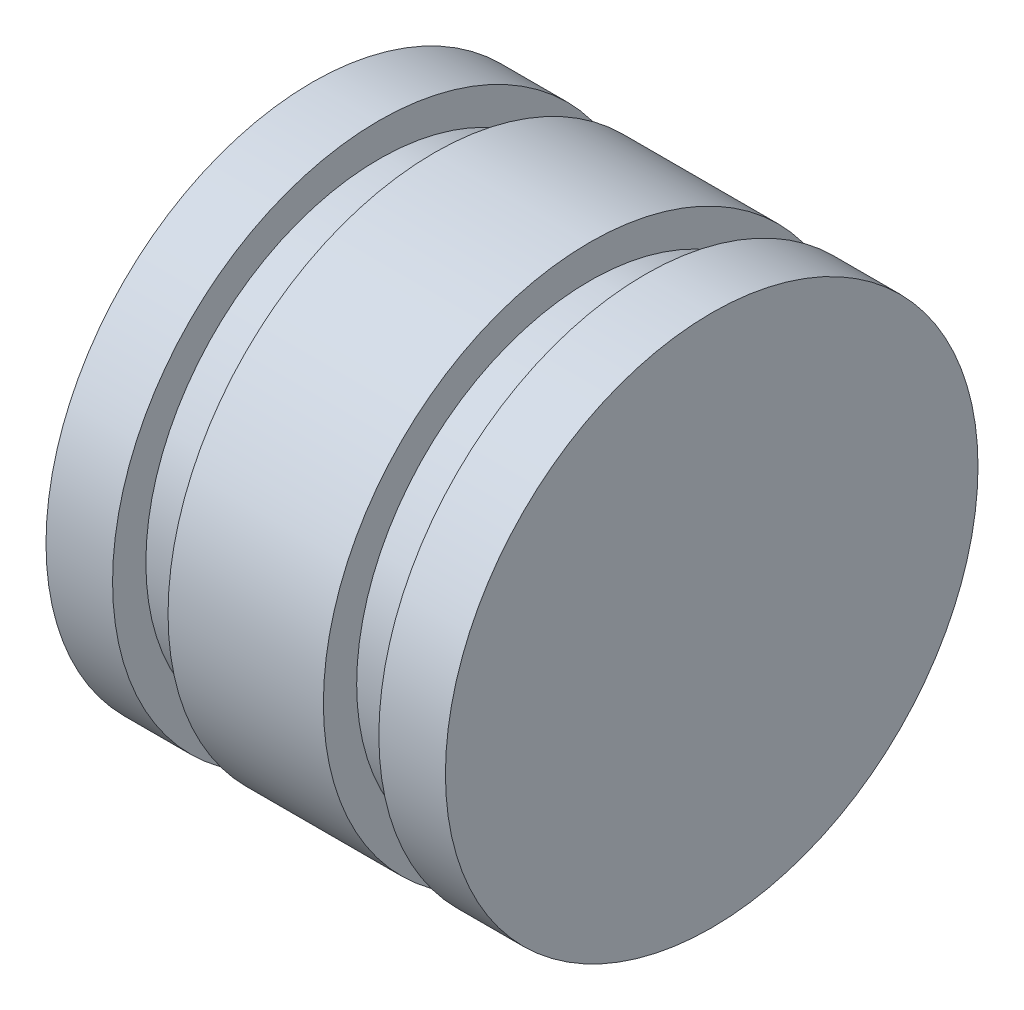
ISO-10303-21;
HEADER;
FILE_DESCRIPTION(('STEP AP214'),'2;1');
FILE_NAME('part.step','',(''),(''),'','','');
FILE_SCHEMA(('AUTOMOTIVE_DESIGN { 1 0 10303 214 1 1 1 1 }'));
ENDSEC;
DATA;
#1=APPLICATION_CONTEXT('core data for automotive mechanical design processes');
#2=APPLICATION_PROTOCOL_DEFINITION('international standard','automotive_design',2000,#1);
#3=PRODUCT_CONTEXT('',#1,'mechanical');
#4=PRODUCT('Part','Part','',(#3));
#5=PRODUCT_RELATED_PRODUCT_CATEGORY('part','',(#4));
#6=PRODUCT_DEFINITION_FORMATION('','',#4);
#7=PRODUCT_DEFINITION_CONTEXT('part definition',#1,'design');
#8=PRODUCT_DEFINITION('design','',#6,#7);
#9=PRODUCT_DEFINITION_SHAPE('','',#8);
#10=(LENGTH_UNIT() NAMED_UNIT(*) SI_UNIT(.MILLI.,.METRE.));
#11=(NAMED_UNIT(*) PLANE_ANGLE_UNIT() SI_UNIT($,.RADIAN.));
#12=(NAMED_UNIT(*) SI_UNIT($,.STERADIAN.) SOLID_ANGLE_UNIT());
#13=UNCERTAINTY_MEASURE_WITH_UNIT(LENGTH_MEASURE(1.E-05),#10,'distance_accuracy_value','');
#14=(GEOMETRIC_REPRESENTATION_CONTEXT(3) GLOBAL_UNCERTAINTY_ASSIGNED_CONTEXT((#13)) GLOBAL_UNIT_ASSIGNED_CONTEXT((#10,
#11,#12)) REPRESENTATION_CONTEXT('',''));
#15=CARTESIAN_POINT('',(0.,0.,0.));
#16=DIRECTION('',(0.,0.,1.));
#17=DIRECTION('',(1.,0.,0.));
#18=AXIS2_PLACEMENT_3D('',#15,#16,#17);
#19=CARTESIAN_POINT('',(-21.3192957770043,0.,-6.3939393939394));
#20=DIRECTION('',(-1.,0.,0.));
#21=DIRECTION('',(0.,0.,1.));
#22=AXIS2_PLACEMENT_3D('',#19,#20,#21);
#23=CYLINDRICAL_SURFACE('',#22,12.);
#24=CARTESIAN_POINT('',(-3.31929577700428,0.,-6.3939393939394));
#25=DIRECTION('',(-1.,0.,0.));
#26=DIRECTION('',(0.,0.,1.));
#27=AXIS2_PLACEMENT_3D('',#24,#25,#26);
#28=CIRCLE('',#27,12.);
#29=CARTESIAN_POINT('',(-3.31929577700428,0.,5.6060606060606));
#30=VERTEX_POINT('',#29);
#31=EDGE_CURVE('E67',#30,#30,#28,.T.);
#32=ORIENTED_EDGE('',*,*,#31,.T.);
#33=EDGE_LOOP('',(#32));
#34=FACE_BOUND('',#33,.T.);
#35=CARTESIAN_POINT('',(-6.31929577700428,0.,-6.3939393939394));
#36=DIRECTION('',(-1.,0.,0.));
#37=DIRECTION('',(0.,0.,1.));
#38=AXIS2_PLACEMENT_3D('',#35,#36,#37);
#39=CIRCLE('',#38,12.);
#40=CARTESIAN_POINT('',(-6.31929577700428,0.,5.6060606060606));
#41=VERTEX_POINT('',#40);
#42=EDGE_CURVE('E10',#41,#41,#39,.T.);
#43=ORIENTED_EDGE('',*,*,#42,.F.);
#44=EDGE_LOOP('',(#43));
#45=FACE_BOUND('',#44,.T.);
#46=ADVANCED_FACE('F33',(#34,#45),#23,.T.);
#47=CARTESIAN_POINT('',(-6.31929577700428,0.,4.1060606060606));
#48=DIRECTION('',(-1.,0.,0.));
#49=DIRECTION('',(0.,0.,1.));
#50=AXIS2_PLACEMENT_3D('',#47,#48,#49);
#51=PLANE('',#50);
#52=ORIENTED_EDGE('',*,*,#42,.T.);
#53=EDGE_LOOP('',(#52));
#54=FACE_BOUND('',#53,.T.);
#55=CARTESIAN_POINT('',(-6.31929577700428,0.,-6.3939393939394));
#56=DIRECTION('',(-1.,0.,0.));
#57=DIRECTION('',(0.,0.,1.));
#58=AXIS2_PLACEMENT_3D('',#55,#56,#57);
#59=CIRCLE('',#58,10.5);
#60=CARTESIAN_POINT('',(-6.31929577700428,0.,4.1060606060606));
#61=VERTEX_POINT('',#60);
#62=EDGE_CURVE('E39',#61,#61,#59,.T.);
#63=ORIENTED_EDGE('',*,*,#62,.F.);
#64=EDGE_LOOP('',(#63));
#65=FACE_BOUND('',#64,.T.);
#66=ADVANCED_FACE('F84',(#54,#65),#51,.T.);
#67=CARTESIAN_POINT('',(-21.3192957770043,0.,-6.3939393939394));
#68=DIRECTION('',(-1.,0.,0.));
#69=DIRECTION('',(0.,0.,1.));
#70=AXIS2_PLACEMENT_3D('',#67,#68,#69);
#71=CYLINDRICAL_SURFACE('',#70,10.5);
#72=ORIENTED_EDGE('',*,*,#62,.T.);
#73=EDGE_LOOP('',(#72));
#74=FACE_BOUND('',#73,.T.);
#75=CARTESIAN_POINT('',(-8.81929577700428,0.,-6.3939393939394));
#76=DIRECTION('',(-1.,0.,0.));
#77=DIRECTION('',(0.,0.,1.));
#78=AXIS2_PLACEMENT_3D('',#75,#76,#77);
#79=CIRCLE('',#78,10.5);
#80=CARTESIAN_POINT('',(-8.81929577700428,0.,4.1060606060606));
#81=VERTEX_POINT('',#80);
#82=EDGE_CURVE('E43',#81,#81,#79,.T.);
#83=ORIENTED_EDGE('',*,*,#82,.F.);
#84=EDGE_LOOP('',(#83));
#85=FACE_BOUND('',#84,.T.);
#86=ADVANCED_FACE('F88',(#74,#85),#71,.T.);
#87=CARTESIAN_POINT('',(-8.81929577700428,0.,5.6060606060606));
#88=DIRECTION('',(1.,0.,0.));
#89=DIRECTION('',(0.,0.,-1.));
#90=AXIS2_PLACEMENT_3D('',#87,#88,#89);
#91=PLANE('',#90);
#92=ORIENTED_EDGE('',*,*,#82,.T.);
#93=EDGE_LOOP('',(#92));
#94=FACE_BOUND('',#93,.T.);
#95=CARTESIAN_POINT('',(-8.81929577700428,0.,-6.3939393939394));
#96=DIRECTION('',(-1.,0.,0.));
#97=DIRECTION('',(0.,0.,1.));
#98=AXIS2_PLACEMENT_3D('',#95,#96,#97);
#99=CIRCLE('',#98,12.);
#100=CARTESIAN_POINT('',(-8.81929577700428,0.,5.6060606060606));
#101=VERTEX_POINT('',#100);
#102=EDGE_CURVE('E47',#101,#101,#99,.T.);
#103=ORIENTED_EDGE('',*,*,#102,.F.);
#104=EDGE_LOOP('',(#103));
#105=FACE_BOUND('',#104,.T.);
#106=ADVANCED_FACE('F92',(#94,#105),#91,.T.);
#107=CARTESIAN_POINT('',(-21.3192957770043,0.,-6.3939393939394));
#108=DIRECTION('',(-1.,0.,0.));
#109=DIRECTION('',(0.,0.,1.));
#110=AXIS2_PLACEMENT_3D('',#107,#108,#109);
#111=CYLINDRICAL_SURFACE('',#110,12.);
#112=ORIENTED_EDGE('',*,*,#102,.T.);
#113=EDGE_LOOP('',(#112));
#114=FACE_BOUND('',#113,.T.);
#115=CARTESIAN_POINT('',(-15.8192957770043,0.,-6.3939393939394));
#116=DIRECTION('',(-1.,0.,0.));
#117=DIRECTION('',(0.,0.,1.));
#118=AXIS2_PLACEMENT_3D('',#115,#116,#117);
#119=CIRCLE('',#118,12.);
#120=CARTESIAN_POINT('',(-15.8192957770043,0.,5.6060606060606));
#121=VERTEX_POINT('',#120);
#122=EDGE_CURVE('E52',#121,#121,#119,.T.);
#123=ORIENTED_EDGE('',*,*,#122,.F.);
#124=EDGE_LOOP('',(#123));
#125=FACE_BOUND('',#124,.T.);
#126=ADVANCED_FACE('F98',(#114,#125),#111,.T.);
#127=CARTESIAN_POINT('',(-15.8192957770043,0.,4.10606060606061));
#128=DIRECTION('',(-1.,0.,0.));
#129=DIRECTION('',(0.,0.,1.));
#130=AXIS2_PLACEMENT_3D('',#127,#128,#129);
#131=PLANE('',#130);
#132=ORIENTED_EDGE('',*,*,#122,.T.);
#133=EDGE_LOOP('',(#132));
#134=FACE_BOUND('',#133,.T.);
#135=CARTESIAN_POINT('',(-15.8192957770043,0.,-6.3939393939394));
#136=DIRECTION('',(-1.,0.,0.));
#137=DIRECTION('',(0.,0.,1.));
#138=AXIS2_PLACEMENT_3D('',#135,#136,#137);
#139=CIRCLE('',#138,10.5);
#140=CARTESIAN_POINT('',(-15.8192957770043,0.,4.10606060606061));
#141=VERTEX_POINT('',#140);
#142=EDGE_CURVE('E55',#141,#141,#139,.T.);
#143=ORIENTED_EDGE('',*,*,#142,.F.);
#144=EDGE_LOOP('',(#143));
#145=FACE_BOUND('',#144,.T.);
#146=ADVANCED_FACE('F102',(#134,#145),#131,.T.);
#147=CARTESIAN_POINT('',(-21.3192957770043,0.,-6.3939393939394));
#148=DIRECTION('',(-1.,0.,0.));
#149=DIRECTION('',(0.,0.,1.));
#150=AXIS2_PLACEMENT_3D('',#147,#148,#149);
#151=CYLINDRICAL_SURFACE('',#150,10.5);
#152=ORIENTED_EDGE('',*,*,#142,.T.);
#153=EDGE_LOOP('',(#152));
#154=FACE_BOUND('',#153,.T.);
#155=CARTESIAN_POINT('',(-18.3192957770043,0.,-6.3939393939394));
#156=DIRECTION('',(-1.,0.,0.));
#157=DIRECTION('',(0.,0.,1.));
#158=AXIS2_PLACEMENT_3D('',#155,#156,#157);
#159=CIRCLE('',#158,10.5);
#160=CARTESIAN_POINT('',(-18.3192957770043,0.,4.1060606060606));
#161=VERTEX_POINT('',#160);
#162=EDGE_CURVE('E58',#161,#161,#159,.T.);
#163=ORIENTED_EDGE('',*,*,#162,.F.);
#164=EDGE_LOOP('',(#163));
#165=FACE_BOUND('',#164,.T.);
#166=ADVANCED_FACE('F106',(#154,#165),#151,.T.);
#167=CARTESIAN_POINT('',(-18.3192957770043,0.,5.6060606060606));
#168=DIRECTION('',(1.,0.,0.));
#169=DIRECTION('',(0.,0.,-1.));
#170=AXIS2_PLACEMENT_3D('',#167,#168,#169);
#171=PLANE('',#170);
#172=ORIENTED_EDGE('',*,*,#162,.T.);
#173=EDGE_LOOP('',(#172));
#174=FACE_BOUND('',#173,.T.);
#175=CARTESIAN_POINT('',(-18.3192957770043,0.,-6.3939393939394));
#176=DIRECTION('',(-1.,0.,0.));
#177=DIRECTION('',(0.,0.,1.));
#178=AXIS2_PLACEMENT_3D('',#175,#176,#177);
#179=CIRCLE('',#178,12.);
#180=CARTESIAN_POINT('',(-18.3192957770043,0.,5.6060606060606));
#181=VERTEX_POINT('',#180);
#182=EDGE_CURVE('E61',#181,#181,#179,.T.);
#183=ORIENTED_EDGE('',*,*,#182,.F.);
#184=EDGE_LOOP('',(#183));
#185=FACE_BOUND('',#184,.T.);
#186=ADVANCED_FACE('F110',(#174,#185),#171,.T.);
#187=CARTESIAN_POINT('',(-21.3192957770043,0.,-6.3939393939394));
#188=DIRECTION('',(-1.,0.,0.));
#189=DIRECTION('',(0.,0.,1.));
#190=AXIS2_PLACEMENT_3D('',#187,#188,#189);
#191=CYLINDRICAL_SURFACE('',#190,12.);
#192=ORIENTED_EDGE('',*,*,#182,.T.);
#193=EDGE_LOOP('',(#192));
#194=FACE_BOUND('',#193,.T.);
#195=CARTESIAN_POINT('',(-21.3192957770043,0.,-6.3939393939394));
#196=DIRECTION('',(-1.,0.,0.));
#197=DIRECTION('',(0.,0.,1.));
#198=AXIS2_PLACEMENT_3D('',#195,#196,#197);
#199=CIRCLE('',#198,12.);
#200=CARTESIAN_POINT('',(-21.3192957770043,0.,5.60606060606061));
#201=VERTEX_POINT('',#200);
#202=EDGE_CURVE('E64',#201,#201,#199,.T.);
#203=ORIENTED_EDGE('',*,*,#202,.F.);
#204=EDGE_LOOP('',(#203));
#205=FACE_BOUND('',#204,.T.);
#206=ADVANCED_FACE('F80',(#194,#205),#191,.T.);
#207=CARTESIAN_POINT('',(-21.3192957770043,0.,-6.3939393939394));
#208=DIRECTION('',(-1.,0.,0.));
#209=DIRECTION('',(0.,0.,1.));
#210=AXIS2_PLACEMENT_3D('',#207,#208,#209);
#211=PLANE('',#210);
#212=ORIENTED_EDGE('',*,*,#202,.T.);
#213=EDGE_LOOP('',(#212));
#214=FACE_BOUND('',#213,.T.);
#215=ADVANCED_FACE('F75',(#214),#211,.T.);
#216=CARTESIAN_POINT('',(-3.31929577700428,0.,-6.3939393939394));
#217=DIRECTION('',(1.,0.,0.));
#218=DIRECTION('',(0.,0.,-1.));
#219=AXIS2_PLACEMENT_3D('',#216,#217,#218);
#220=PLANE('',#219);
#221=ORIENTED_EDGE('',*,*,#31,.F.);
#222=EDGE_LOOP('',(#221));
#223=FACE_BOUND('',#222,.T.);
#224=ADVANCED_FACE('F73',(#223),#220,.T.);
#225=CLOSED_SHELL('',(#46,#66,#86,#106,#126,#146,#166,#186,#206,#215,#224));
#226=MANIFOLD_SOLID_BREP('B2',#225);
#227=ADVANCED_BREP_SHAPE_REPRESENTATION('',(#18,#226),#14);
#228=SHAPE_DEFINITION_REPRESENTATION(#9,#227);
ENDSEC;
END-ISO-10303-21;
